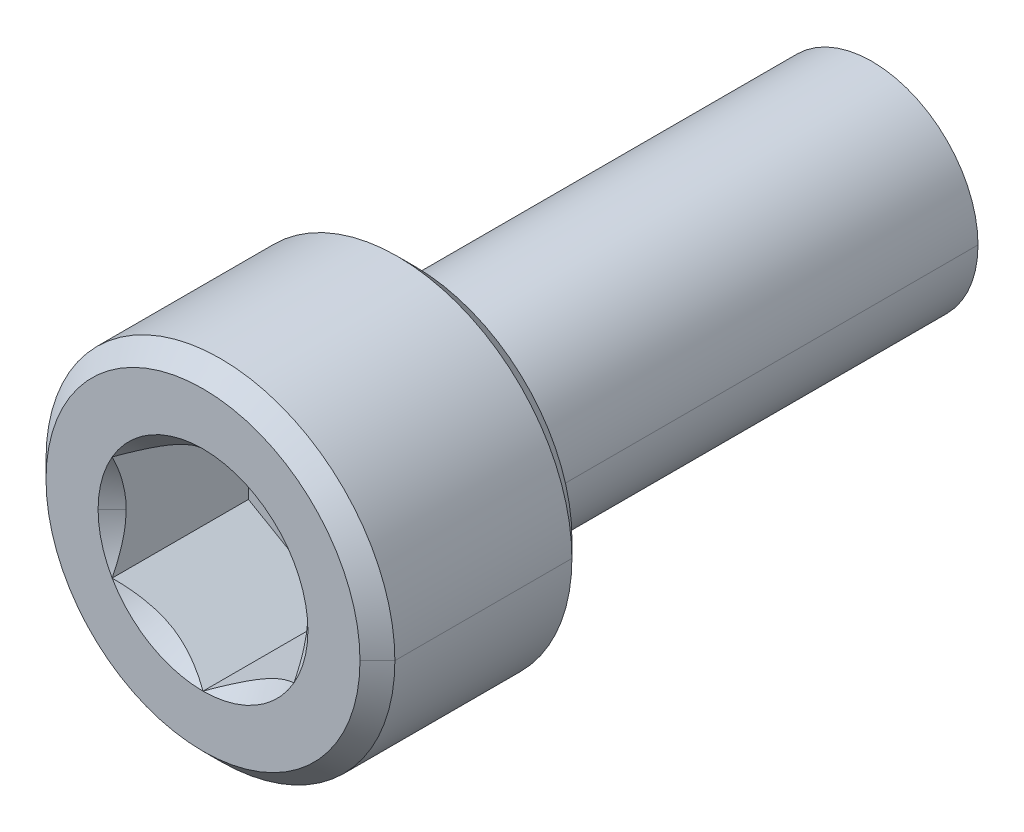
ISO-10303-21;
HEADER;
FILE_DESCRIPTION(('STEP AP214'),'2;1');
FILE_NAME('part.step','',(''),(''),'','','');
FILE_SCHEMA(('AUTOMOTIVE_DESIGN { 1 0 10303 214 1 1 1 1 }'));
ENDSEC;
DATA;
#1=APPLICATION_CONTEXT('core data for automotive mechanical design processes');
#2=APPLICATION_PROTOCOL_DEFINITION('international standard','automotive_design',2000,#1);
#3=PRODUCT_CONTEXT('',#1,'mechanical');
#4=PRODUCT('Part','Part','',(#3));
#5=PRODUCT_RELATED_PRODUCT_CATEGORY('part','',(#4));
#6=PRODUCT_DEFINITION_FORMATION('','',#4);
#7=PRODUCT_DEFINITION_CONTEXT('part definition',#1,'design');
#8=PRODUCT_DEFINITION('design','',#6,#7);
#9=PRODUCT_DEFINITION_SHAPE('','',#8);
#10=(LENGTH_UNIT() NAMED_UNIT(*) SI_UNIT(.MILLI.,.METRE.));
#11=(NAMED_UNIT(*) PLANE_ANGLE_UNIT() SI_UNIT($,.RADIAN.));
#12=(NAMED_UNIT(*) SI_UNIT($,.STERADIAN.) SOLID_ANGLE_UNIT());
#13=UNCERTAINTY_MEASURE_WITH_UNIT(LENGTH_MEASURE(1.E-05),#10,'distance_accuracy_value','');
#14=(GEOMETRIC_REPRESENTATION_CONTEXT(3) GLOBAL_UNCERTAINTY_ASSIGNED_CONTEXT((#13)) GLOBAL_UNIT_ASSIGNED_CONTEXT((#10,
#11,#12)) REPRESENTATION_CONTEXT('',''));
#15=CARTESIAN_POINT('',(0.,0.,0.));
#16=DIRECTION('',(0.,0.,1.));
#17=DIRECTION('',(1.,0.,0.));
#18=AXIS2_PLACEMENT_3D('',#15,#16,#17);
#19=CARTESIAN_POINT('',(10.3682102585368,0.,2.8429));
#20=DIRECTION('',(0.,0.,1.));
#21=DIRECTION('',(-1.,0.,0.));
#22=AXIS2_PLACEMENT_3D('',#19,#20,#21);
#23=CONICAL_SURFACE('',#22,3.429,0.785398163397452);
#24=DIRECTION('',(0.70710678118655,0.,0.707106781186545));
#25=VECTOR('',#24,1.);
#26=CARTESIAN_POINT('',(13.7972102585368,0.,2.8429));
#27=LINE('',#26,#25);
#28=CARTESIAN_POINT('',(13.4543102585468,0.,2.50000000001));
#29=VERTEX_POINT('',#28);
#30=CARTESIAN_POINT('',(13.7972102585468,0.,2.84290000001));
#31=VERTEX_POINT('',#30);
#32=EDGE_CURVE('E492',#29,#31,#27,.T.);
#33=ORIENTED_EDGE('',*,*,#32,.F.);
#34=CARTESIAN_POINT('',(10.3682102585368,0.,2.50000000001));
#35=DIRECTION('',(0.,0.,-1.));
#36=DIRECTION('',(-1.,0.,0.));
#37=AXIS2_PLACEMENT_3D('',#34,#35,#36);
#38=CIRCLE('',#37,3.08610000001);
#39=CARTESIAN_POINT('',(7.2821102585268,0.,2.50000000001));
#40=VERTEX_POINT('',#39);
#41=EDGE_CURVE('E209',#40,#29,#38,.T.);
#42=ORIENTED_EDGE('',*,*,#41,.F.);
#43=DIRECTION('',(-0.70710678118655,0.,0.707106781186545));
#44=VECTOR('',#43,1.);
#45=CARTESIAN_POINT('',(6.9392102585368,0.,2.8429));
#46=LINE('',#45,#44);
#47=CARTESIAN_POINT('',(6.9392102585268,0.,2.84290000001));
#48=VERTEX_POINT('',#47);
#49=EDGE_CURVE('E497',#40,#48,#46,.T.);
#50=ORIENTED_EDGE('',*,*,#49,.T.);
#51=CARTESIAN_POINT('',(10.3682102585368,0.,2.84290000001));
#52=DIRECTION('',(0.,0.,1.));
#53=DIRECTION('',(-1.,0.,0.));
#54=AXIS2_PLACEMENT_3D('',#51,#52,#53);
#55=CIRCLE('',#54,3.42900000001);
#56=EDGE_CURVE('E11',#31,#48,#55,.T.);
#57=ORIENTED_EDGE('',*,*,#56,.F.);
#58=EDGE_LOOP('',(#33,#42,#50,#57));
#59=FACE_BOUND('',#58,.T.);
#60=ADVANCED_FACE('F17',(#59),#23,.T.);
#61=CARTESIAN_POINT('',(10.3682102585368,0.,6.6656));
#62=DIRECTION('',(0.,0.,-1.));
#63=DIRECTION('',(1.,0.,0.));
#64=AXIS2_PLACEMENT_3D('',#61,#62,#63);
#65=CONICAL_SURFACE('',#64,3.0861,0.785398163397446);
#66=DIRECTION('',(-0.707106781186546,0.,-0.707106781186549));
#67=VECTOR('',#66,1.);
#68=CARTESIAN_POINT('',(7.2821102585368,0.,6.6656));
#69=LINE('',#68,#67);
#70=CARTESIAN_POINT('',(7.28211025852679,0.,6.66560000001));
#71=VERTEX_POINT('',#70);
#72=CARTESIAN_POINT('',(6.9392102585268,0.,6.32270000001));
#73=VERTEX_POINT('',#72);
#74=EDGE_CURVE('E304',#71,#73,#69,.T.);
#75=ORIENTED_EDGE('',*,*,#74,.F.);
#76=CARTESIAN_POINT('',(10.3682102585368,0.,6.66560000001));
#77=DIRECTION('',(0.,0.,1.));
#78=DIRECTION('',(-1.,0.,0.));
#79=AXIS2_PLACEMENT_3D('',#76,#77,#78);
#80=CIRCLE('',#79,3.08610000001001);
#81=CARTESIAN_POINT('',(13.4543102585468,0.,6.66560000001));
#82=VERTEX_POINT('',#81);
#83=EDGE_CURVE('E247',#82,#71,#80,.T.);
#84=ORIENTED_EDGE('',*,*,#83,.F.);
#85=DIRECTION('',(0.707106781186546,0.,-0.707106781186549));
#86=VECTOR('',#85,1.);
#87=CARTESIAN_POINT('',(13.4543102585368,0.,6.6656));
#88=LINE('',#87,#86);
#89=CARTESIAN_POINT('',(13.7972102585468,0.,6.32270000001));
#90=VERTEX_POINT('',#89);
#91=EDGE_CURVE('E294',#82,#90,#88,.T.);
#92=ORIENTED_EDGE('',*,*,#91,.T.);
#93=CARTESIAN_POINT('',(10.3682102585368,0.,6.32270000001));
#94=DIRECTION('',(0.,0.,-1.));
#95=DIRECTION('',(-1.,0.,0.));
#96=AXIS2_PLACEMENT_3D('',#93,#94,#95);
#97=CIRCLE('',#96,3.42900000001);
#98=EDGE_CURVE('E29',#73,#90,#97,.T.);
#99=ORIENTED_EDGE('',*,*,#98,.F.);
#100=EDGE_LOOP('',(#75,#84,#92,#99));
#101=FACE_BOUND('',#100,.T.);
#102=ADVANCED_FACE('F295',(#101),#65,.T.);
#103=CARTESIAN_POINT('',(10.3682102585368,0.,6.6656));
#104=DIRECTION('',(0.,0.,1.));
#105=DIRECTION('',(-1.,0.,0.));
#106=AXIS2_PLACEMENT_3D('',#103,#104,#105);
#107=CONICAL_SURFACE('',#106,2.0622229927617,0.78539816339745);
#108=DIRECTION('',(-0.707106781186549,0.,0.707106781186546));
#109=VECTOR('',#108,1.);
#110=CARTESIAN_POINT('',(8.3059872657751,0.,6.6656));
#111=LINE('',#110,#109);
#112=CARTESIAN_POINT('',(8.58227275853682,0.,6.3893145072383));
#113=VERTEX_POINT('',#112);
#114=CARTESIAN_POINT('',(8.3059872657651,0.,6.66560000001));
#115=VERTEX_POINT('',#114);
#116=EDGE_CURVE('E406',#113,#115,#111,.T.);
#117=ORIENTED_EDGE('',*,*,#116,.F.);
#118=CARTESIAN_POINT('',(8.58227275853682,1.03111149638085,6.6656));
#119=CARTESIAN_POINT('',(8.58227275853682,0.478540510842383,6.3893145072383));
#120=CARTESIAN_POINT('',(8.58227275853682,0.,6.3893145072383));
#121=B_SPLINE_CURVE_WITH_KNOTS('',2,(#118,#119,#120),.UNSPECIFIED.,.F.,.F.,(3,3),(0.,1.),.UNSPECIFIED.);
#122=CARTESIAN_POINT('',(8.58227275853682,1.03111149638085,6.6656));
#123=VERTEX_POINT('',#122);
#124=EDGE_CURVE('E341',#123,#113,#121,.T.);
#125=ORIENTED_EDGE('',*,*,#124,.F.);
#126=CARTESIAN_POINT('',(10.3682102585368,0.,6.66560000001));
#127=DIRECTION('',(0.,0.,1.));
#128=DIRECTION('',(-1.,0.,0.));
#129=AXIS2_PLACEMENT_3D('',#126,#127,#128);
#130=CIRCLE('',#129,2.0622229927717);
#131=EDGE_CURVE('E251',#123,#115,#130,.T.);
#132=ORIENTED_EDGE('',*,*,#131,.T.);
#133=EDGE_LOOP('',(#117,#125,#132));
#134=FACE_BOUND('',#133,.T.);
#135=ADVANCED_FACE('F888',(#134),#107,.F.);
#136=CARTESIAN_POINT('',(10.3682102585368,0.,6.6656));
#137=DIRECTION('',(0.,0.,-1.));
#138=DIRECTION('',(1.,0.,0.));
#139=AXIS2_PLACEMENT_3D('',#136,#137,#138);
#140=CYLINDRICAL_SURFACE('',#139,3.429);
#141=DIRECTION('',(0.,0.,-1.));
#142=VECTOR('',#141,1.);
#143=CARTESIAN_POINT('',(6.9392102585368,0.,6.6656));
#144=LINE('',#143,#142);
#145=EDGE_CURVE('E273',#73,#48,#144,.T.);
#146=ORIENTED_EDGE('',*,*,#145,.F.);
#147=ORIENTED_EDGE('',*,*,#98,.T.);
#148=DIRECTION('',(0.,0.,-1.));
#149=VECTOR('',#148,1.);
#150=CARTESIAN_POINT('',(13.7972102585368,0.,6.6656));
#151=LINE('',#150,#149);
#152=EDGE_CURVE('E269',#90,#31,#151,.T.);
#153=ORIENTED_EDGE('',*,*,#152,.T.);
#154=ORIENTED_EDGE('',*,*,#56,.T.);
#155=EDGE_LOOP('',(#146,#147,#153,#154));
#156=FACE_BOUND('',#155,.T.);
#157=ADVANCED_FACE('F267',(#156),#140,.T.);
#158=CARTESIAN_POINT('',(10.3682102585368,0.,-7.025));
#159=DIRECTION('',(0.,0.,1.));
#160=DIRECTION('',(-1.,0.,0.));
#161=AXIS2_PLACEMENT_3D('',#158,#159,#160);
#162=CONICAL_SURFACE('',#161,1.31324425180957,0.959931088596884);
#163=DIRECTION('',(0.819152044288993,0.,0.573576436351044));
#164=VECTOR('',#163,1.);
#165=CARTESIAN_POINT('',(11.6814545103464,0.,-7.025));
#166=LINE('',#165,#164);
#167=CARTESIAN_POINT('',(11.6814545103564,0.,-7.025));
#168=VERTEX_POINT('',#167);
#169=CARTESIAN_POINT('',(12.4510102585468,0.,-6.48615126403445));
#170=VERTEX_POINT('',#169);
#171=EDGE_CURVE('E506',#168,#170,#166,.T.);
#172=ORIENTED_EDGE('',*,*,#171,.F.);
#173=CARTESIAN_POINT('',(10.3682102585368,0.,-7.025));
#174=DIRECTION('',(0.,0.,-1.));
#175=DIRECTION('',(1.,0.,0.));
#176=AXIS2_PLACEMENT_3D('',#173,#174,#175);
#177=CIRCLE('',#176,1.31324425181957);
#178=CARTESIAN_POINT('',(9.05496600671723,0.,-7.025));
#179=VERTEX_POINT('',#178);
#180=EDGE_CURVE('E256',#179,#168,#177,.T.);
#181=ORIENTED_EDGE('',*,*,#180,.F.);
#182=DIRECTION('',(-0.819152044288993,0.,0.573576436351044));
#183=VECTOR('',#182,1.);
#184=CARTESIAN_POINT('',(9.05496600672723,0.,-7.025));
#185=LINE('',#184,#183);
#186=CARTESIAN_POINT('',(8.2854102585268,0.,-6.48615126403445));
#187=VERTEX_POINT('',#186);
#188=EDGE_CURVE('E319',#179,#187,#185,.T.);
#189=ORIENTED_EDGE('',*,*,#188,.T.);
#190=CARTESIAN_POINT('',(10.3682102585368,0.,-6.48615126403445));
#191=DIRECTION('',(0.,0.,-1.));
#192=DIRECTION('',(1.,0.,0.));
#193=AXIS2_PLACEMENT_3D('',#190,#191,#192);
#194=CIRCLE('',#193,2.08280000001);
#195=EDGE_CURVE('E252',#187,#170,#194,.T.);
#196=ORIENTED_EDGE('',*,*,#195,.T.);
#197=EDGE_LOOP('',(#172,#181,#189,#196));
#198=FACE_BOUND('',#197,.T.);
#199=ADVANCED_FACE('F827',(#198),#162,.T.);
#200=CARTESIAN_POINT('',(10.3682102585368,0.,2.5));
#201=DIRECTION('',(0.,0.,-1.));
#202=DIRECTION('',(1.,0.,0.));
#203=AXIS2_PLACEMENT_3D('',#200,#201,#202);
#204=CYLINDRICAL_SURFACE('',#203,2.0828);
#205=DIRECTION('',(0.,0.,-1.));
#206=VECTOR('',#205,1.);
#207=CARTESIAN_POINT('',(8.2854102585368,0.,2.5));
#208=LINE('',#207,#206);
#209=CARTESIAN_POINT('',(8.2854102585268,0.,2.50000000001));
#210=VERTEX_POINT('',#209);
#211=EDGE_CURVE('E324',#210,#187,#208,.T.);
#212=ORIENTED_EDGE('',*,*,#211,.F.);
#213=CARTESIAN_POINT('',(10.3682102585368,0.,2.50000000001));
#214=DIRECTION('',(0.,0.,-1.));
#215=DIRECTION('',(-1.,0.,0.));
#216=AXIS2_PLACEMENT_3D('',#213,#214,#215);
#217=CIRCLE('',#216,2.08280000001);
#218=CARTESIAN_POINT('',(12.4510102585468,0.,2.50000000001));
#219=VERTEX_POINT('',#218);
#220=EDGE_CURVE('E243',#210,#219,#217,.T.);
#221=ORIENTED_EDGE('',*,*,#220,.T.);
#222=DIRECTION('',(0.,0.,-1.));
#223=VECTOR('',#222,1.);
#224=CARTESIAN_POINT('',(12.4510102585368,0.,2.5));
#225=LINE('',#224,#223);
#226=EDGE_CURVE('E328',#219,#170,#225,.T.);
#227=ORIENTED_EDGE('',*,*,#226,.T.);
#228=ORIENTED_EDGE('',*,*,#195,.F.);
#229=EDGE_LOOP('',(#212,#221,#227,#228));
#230=FACE_BOUND('',#229,.T.);
#231=ADVANCED_FACE('F148',(#230),#204,.T.);
#232=CARTESIAN_POINT('',(10.3682102585368,0.,-7.025));
#233=DIRECTION('',(0.,0.,-1.));
#234=DIRECTION('',(0.,-1.,0.));
#235=AXIS2_PLACEMENT_3D('',#232,#233,#234);
#236=PLANE('',#235);
#237=ORIENTED_EDGE('',*,*,#180,.T.);
#238=CARTESIAN_POINT('',(10.3682102585368,0.,-7.025));
#239=DIRECTION('',(0.,0.,-1.));
#240=DIRECTION('',(1.,0.,0.));
#241=AXIS2_PLACEMENT_3D('',#238,#239,#240);
#242=CIRCLE('',#241,1.31324425181957);
#243=EDGE_CURVE('E290',#168,#179,#242,.T.);
#244=ORIENTED_EDGE('',*,*,#243,.T.);
#245=EDGE_LOOP('',(#237,#244));
#246=FACE_BOUND('',#245,.T.);
#247=ADVANCED_FACE('F802',(#246),#236,.T.);
#248=CARTESIAN_POINT('',(10.3682102585368,0.,6.6656));
#249=DIRECTION('',(0.,0.,1.));
#250=DIRECTION('',(1.,0.,0.));
#251=AXIS2_PLACEMENT_3D('',#248,#249,#250);
#252=PLANE('',#251);
#253=CARTESIAN_POINT('',(10.3682102585368,0.,6.66560000001));
#254=DIRECTION('',(0.,0.,1.));
#255=DIRECTION('',(-1.,0.,0.));
#256=AXIS2_PLACEMENT_3D('',#253,#254,#255);
#257=CIRCLE('',#256,2.0622229927717);
#258=CARTESIAN_POINT('',(8.58227275853682,-1.03111149638085,6.6656));
#259=VERTEX_POINT('',#258);
#260=CARTESIAN_POINT('',(10.3682102585368,-2.0622229927617,6.6656));
#261=VERTEX_POINT('',#260);
#262=EDGE_CURVE('E212',#259,#261,#257,.T.);
#263=ORIENTED_EDGE('',*,*,#262,.F.);
#264=CARTESIAN_POINT('',(10.3682102585368,0.,6.66560000001));
#265=DIRECTION('',(0.,0.,1.));
#266=DIRECTION('',(-1.,0.,0.));
#267=AXIS2_PLACEMENT_3D('',#264,#265,#266);
#268=CIRCLE('',#267,2.0622229927717);
#269=EDGE_CURVE('E318',#115,#259,#268,.T.);
#270=ORIENTED_EDGE('',*,*,#269,.F.);
#271=ORIENTED_EDGE('',*,*,#131,.F.);
#272=CARTESIAN_POINT('',(10.3682102585368,0.,6.66560000001));
#273=DIRECTION('',(0.,0.,1.));
#274=DIRECTION('',(-1.,0.,0.));
#275=AXIS2_PLACEMENT_3D('',#272,#273,#274);
#276=CIRCLE('',#275,2.0622229927717);
#277=CARTESIAN_POINT('',(10.3682102585368,2.0622229927617,6.6656));
#278=VERTEX_POINT('',#277);
#279=EDGE_CURVE('E89',#278,#123,#276,.T.);
#280=ORIENTED_EDGE('',*,*,#279,.F.);
#281=CARTESIAN_POINT('',(10.3682102585368,0.,6.66560000001));
#282=DIRECTION('',(0.,0.,1.));
#283=DIRECTION('',(-1.,0.,0.));
#284=AXIS2_PLACEMENT_3D('',#281,#282,#283);
#285=CIRCLE('',#284,2.0622229927717);
#286=CARTESIAN_POINT('',(12.1541477585368,1.03111149638085,6.6656));
#287=VERTEX_POINT('',#286);
#288=EDGE_CURVE('E82',#287,#278,#285,.T.);
#289=ORIENTED_EDGE('',*,*,#288,.F.);
#290=CARTESIAN_POINT('',(10.3682102585368,0.,6.66560000001));
#291=DIRECTION('',(0.,0.,1.));
#292=DIRECTION('',(-1.,0.,0.));
#293=AXIS2_PLACEMENT_3D('',#290,#291,#292);
#294=CIRCLE('',#293,2.0622229927717);
#295=CARTESIAN_POINT('',(12.1541477585368,-1.03111149638085,6.6656));
#296=VERTEX_POINT('',#295);
#297=EDGE_CURVE('E72',#296,#287,#294,.T.);
#298=ORIENTED_EDGE('',*,*,#297,.F.);
#299=CARTESIAN_POINT('',(10.3682102585368,0.,6.66560000001));
#300=DIRECTION('',(0.,0.,1.));
#301=DIRECTION('',(-1.,0.,0.));
#302=AXIS2_PLACEMENT_3D('',#299,#300,#301);
#303=CIRCLE('',#302,2.0622229927717);
#304=EDGE_CURVE('E42',#261,#296,#303,.T.);
#305=ORIENTED_EDGE('',*,*,#304,.F.);
#306=EDGE_LOOP('',(#263,#270,#271,#280,#289,#298,#305));
#307=FACE_BOUND('',#306,.T.);
#308=ORIENTED_EDGE('',*,*,#83,.T.);
#309=CARTESIAN_POINT('',(10.3682102585368,0.,6.66560000001));
#310=DIRECTION('',(0.,0.,1.));
#311=DIRECTION('',(-1.,0.,0.));
#312=AXIS2_PLACEMENT_3D('',#309,#310,#311);
#313=CIRCLE('',#312,3.08610000001001);
#314=EDGE_CURVE('E310',#71,#82,#313,.T.);
#315=ORIENTED_EDGE('',*,*,#314,.T.);
#316=EDGE_LOOP('',(#308,#315));
#317=FACE_BOUND('',#316,.T.);
#318=ADVANCED_FACE('F86',(#307,#317),#252,.T.);
#319=CARTESIAN_POINT('',(10.3682102585368,0.,2.5));
#320=DIRECTION('',(0.,0.,1.));
#321=DIRECTION('',(1.,0.,0.));
#322=AXIS2_PLACEMENT_3D('',#319,#320,#321);
#323=PLANE('',#322);
#324=CARTESIAN_POINT('',(10.3682102585368,0.,2.50000000001));
#325=DIRECTION('',(0.,0.,-1.));
#326=DIRECTION('',(-1.,0.,0.));
#327=AXIS2_PLACEMENT_3D('',#324,#325,#326);
#328=CIRCLE('',#327,2.08280000001);
#329=EDGE_CURVE('E323',#219,#210,#328,.T.);
#330=ORIENTED_EDGE('',*,*,#329,.F.);
#331=ORIENTED_EDGE('',*,*,#220,.F.);
#332=EDGE_LOOP('',(#330,#331));
#333=FACE_BOUND('',#332,.T.);
#334=ORIENTED_EDGE('',*,*,#41,.T.);
#335=CARTESIAN_POINT('',(10.3682102585368,0.,2.50000000001));
#336=DIRECTION('',(0.,0.,-1.));
#337=DIRECTION('',(-1.,0.,0.));
#338=AXIS2_PLACEMENT_3D('',#335,#336,#337);
#339=CIRCLE('',#338,3.08610000001);
#340=EDGE_CURVE('E490',#29,#40,#339,.T.);
#341=ORIENTED_EDGE('',*,*,#340,.T.);
#342=EDGE_LOOP('',(#334,#341));
#343=FACE_BOUND('',#342,.T.);
#344=ADVANCED_FACE('F801',(#333,#343),#323,.F.);
#345=CARTESIAN_POINT('',(10.3682102585368,0.,6.6656));
#346=DIRECTION('',(0.,0.,1.));
#347=DIRECTION('',(-1.,0.,0.));
#348=AXIS2_PLACEMENT_3D('',#345,#346,#347);
#349=CONICAL_SURFACE('',#348,2.0622229927617,0.78539816339745);
#350=ORIENTED_EDGE('',*,*,#304,.T.);
#351=CARTESIAN_POINT('',(10.3682102585368,-2.0622229927617,6.6656));
#352=CARTESIAN_POINT('',(10.8441239207496,-1.78745411177214,6.39083111904718));
#353=CARTESIAN_POINT('',(11.2578899302854,-1.5485661947851,6.38931854547226));
#354=CARTESIAN_POINT('',(11.6729859664147,-1.30891038658632,6.3878011098182));
#355=CARTESIAN_POINT('',(12.1541477585368,-1.03111149638085,6.6656));
#356=B_SPLINE_CURVE_WITH_KNOTS('',2,(#351,#352,#353,#354,#355),.UNSPECIFIED.,.F.,.F.,(3,2,3),
(0.,0.5,1.),.UNSPECIFIED.);
#357=EDGE_CURVE('E197',#261,#296,#356,.T.);
#358=ORIENTED_EDGE('',*,*,#357,.F.);
#359=EDGE_LOOP('',(#350,#358));
#360=FACE_BOUND('',#359,.T.);
#361=ADVANCED_FACE('F159',(#360),#349,.F.);
#362=CARTESIAN_POINT('',(10.3682102585368,0.,6.6656));
#363=DIRECTION('',(0.,0.,1.));
#364=DIRECTION('',(-1.,0.,0.));
#365=AXIS2_PLACEMENT_3D('',#362,#363,#364);
#366=CONICAL_SURFACE('',#365,2.0622229927617,0.78539816339745);
#367=ORIENTED_EDGE('',*,*,#297,.T.);
#368=CARTESIAN_POINT('',(12.1541477585368,-1.03111149638085,6.6656));
#369=CARTESIAN_POINT('',(12.1541477585368,-0.479143676751824,6.38961609020099));
#370=CARTESIAN_POINT('',(12.1541477585368,-0.000112420350078125,6.3893145107866));
#371=CARTESIAN_POINT('',(12.1541477585368,0.47793859333943,6.38901354849482));
#372=CARTESIAN_POINT('',(12.1541477585368,1.03111149638085,6.6656));
#373=B_SPLINE_CURVE_WITH_KNOTS('',2,(#368,#369,#370,#371,#372),.UNSPECIFIED.,.F.,.F.,(3,2,3),
(0.,0.5,1.),.UNSPECIFIED.);
#374=EDGE_CURVE('E76',#296,#287,#373,.T.);
#375=ORIENTED_EDGE('',*,*,#374,.F.);
#376=EDGE_LOOP('',(#367,#375));
#377=FACE_BOUND('',#376,.T.);
#378=ADVANCED_FACE('F74',(#377),#366,.F.);
#379=CARTESIAN_POINT('',(10.3682102585368,0.,6.6656));
#380=DIRECTION('',(0.,0.,1.));
#381=DIRECTION('',(-1.,0.,0.));
#382=AXIS2_PLACEMENT_3D('',#379,#380,#381);
#383=CONICAL_SURFACE('',#382,2.0622229927617,0.78539816339745);
#384=ORIENTED_EDGE('',*,*,#288,.T.);
#385=CARTESIAN_POINT('',(12.1541477585368,1.03111149638085,6.6656));
#386=CARTESIAN_POINT('',(11.6782340963436,1.30588037735913,6.39083111904708));
#387=CARTESIAN_POINT('',(11.2644680867946,1.54476829435377,6.38931854547226));
#388=CARTESIAN_POINT('',(10.8493720506808,1.78442410254362,6.38780110981842));
#389=CARTESIAN_POINT('',(10.3682102585368,2.0622229927617,6.6656));
#390=B_SPLINE_CURVE_WITH_KNOTS('',2,(#385,#386,#387,#388,#389),.UNSPECIFIED.,.F.,.F.,(3,2,3),
(0.,0.5,1.),.UNSPECIFIED.);
#391=EDGE_CURVE('E108',#287,#278,#390,.T.);
#392=ORIENTED_EDGE('',*,*,#391,.F.);
#393=EDGE_LOOP('',(#384,#392));
#394=FACE_BOUND('',#393,.T.);
#395=ADVANCED_FACE('F110',(#394),#383,.F.);
#396=CARTESIAN_POINT('',(10.3682102585368,0.,6.6656));
#397=DIRECTION('',(0.,0.,1.));
#398=DIRECTION('',(-1.,0.,0.));
#399=AXIS2_PLACEMENT_3D('',#396,#397,#398);
#400=CONICAL_SURFACE('',#399,2.0622229927617,0.78539816339745);
#401=ORIENTED_EDGE('',*,*,#279,.T.);
#402=CARTESIAN_POINT('',(10.3682102585368,2.0622229927617,6.6656));
#403=CARTESIAN_POINT('',(9.89229659632461,1.78745411177247,6.39083111904882));
#404=CARTESIAN_POINT('',(9.47853058678823,1.54856619478512,6.38931854547226));
#405=CARTESIAN_POINT('',(9.06343455066165,1.3089103865879,6.3878011098166));
#406=CARTESIAN_POINT('',(8.58227275853681,1.03111149638086,6.6656));
#407=B_SPLINE_CURVE_WITH_KNOTS('',2,(#402,#403,#404,#405,#406),.UNSPECIFIED.,.F.,.F.,(3,2,3),
(0.,0.5,1.),.UNSPECIFIED.);
#408=EDGE_CURVE('E129',#278,#123,#407,.T.);
#409=ORIENTED_EDGE('',*,*,#408,.F.);
#410=EDGE_LOOP('',(#401,#409));
#411=FACE_BOUND('',#410,.T.);
#412=ADVANCED_FACE('F457',(#411),#400,.F.);
#413=CARTESIAN_POINT('',(10.3682102585368,0.,6.6656));
#414=DIRECTION('',(0.,0.,1.));
#415=DIRECTION('',(-1.,0.,0.));
#416=AXIS2_PLACEMENT_3D('',#413,#414,#415);
#417=CONICAL_SURFACE('',#416,2.0622229927617,0.78539816339745);
#418=ORIENTED_EDGE('',*,*,#262,.T.);
#419=CARTESIAN_POINT('',(8.58227275853682,-1.03111149638085,6.6656));
#420=CARTESIAN_POINT('',(9.05818642072837,-1.30588037735816,6.39083111904806));
#421=CARTESIAN_POINT('',(9.47195243027909,-1.54476829435379,6.38931854547227));
#422=CARTESIAN_POINT('',(9.88704846638885,-1.78442410254131,6.38780110981747));
#423=CARTESIAN_POINT('',(10.3682102585368,-2.06222299276169,6.6656));
#424=B_SPLINE_CURVE_WITH_KNOTS('',2,(#419,#420,#421,#422,#423),.UNSPECIFIED.,.F.,.F.,(3,2,3),
(0.,0.5,1.),.UNSPECIFIED.);
#425=EDGE_CURVE('E223',#259,#261,#424,.T.);
#426=ORIENTED_EDGE('',*,*,#425,.F.);
#427=EDGE_LOOP('',(#418,#426));
#428=FACE_BOUND('',#427,.T.);
#429=ADVANCED_FACE('F154',(#428),#417,.F.);
#430=CARTESIAN_POINT('',(12.1541477585368,-3.09333448914254,3.98669375));
#431=DIRECTION('',(0.,0.,1.));
#432=DIRECTION('',(1.,0.,0.));
#433=AXIS2_PLACEMENT_3D('',#430,#431,#432);
#434=PLANE('',#433);
#435=DIRECTION('',(0.866025403784438,-0.5,0.));
#436=VECTOR('',#435,1.);
#437=CARTESIAN_POINT('',(8.58227275852682,-1.03111149639085,3.98669375001));
#438=LINE('',#437,#436);
#439=CARTESIAN_POINT('',(8.58227275853682,-1.03111149638085,3.98669375));
#440=VERTEX_POINT('',#439);
#441=CARTESIAN_POINT('',(10.3682102585368,-2.0622229927617,3.98669375));
#442=VERTEX_POINT('',#441);
#443=EDGE_CURVE('E222',#440,#442,#438,.T.);
#444=ORIENTED_EDGE('',*,*,#443,.T.);
#445=DIRECTION('',(0.866025403784438,0.5,0.));
#446=VECTOR('',#445,1.);
#447=CARTESIAN_POINT('',(10.3682102585368,-2.0622229927717,3.98669375001));
#448=LINE('',#447,#446);
#449=CARTESIAN_POINT('',(12.1541477585368,-1.03111149638085,3.98669375));
#450=VERTEX_POINT('',#449);
#451=EDGE_CURVE('E216',#442,#450,#448,.T.);
#452=ORIENTED_EDGE('',*,*,#451,.T.);
#453=DIRECTION('',(0.,1.,0.));
#454=VECTOR('',#453,1.);
#455=CARTESIAN_POINT('',(12.1541477585468,-1.03111149639085,3.98669375001));
#456=LINE('',#455,#454);
#457=CARTESIAN_POINT('',(12.1541477585368,1.03111149638085,3.98669375));
#458=VERTEX_POINT('',#457);
#459=EDGE_CURVE('E105',#450,#458,#456,.T.);
#460=ORIENTED_EDGE('',*,*,#459,.T.);
#461=DIRECTION('',(-0.866025403784438,0.5,0.));
#462=VECTOR('',#461,1.);
#463=CARTESIAN_POINT('',(12.1541477585468,1.03111149639085,3.98669375001));
#464=LINE('',#463,#462);
#465=CARTESIAN_POINT('',(10.3682102585368,2.0622229927617,3.98669375));
#466=VERTEX_POINT('',#465);
#467=EDGE_CURVE('E116',#458,#466,#464,.T.);
#468=ORIENTED_EDGE('',*,*,#467,.T.);
#469=DIRECTION('',(-0.866025403784438,-0.5,0.));
#470=VECTOR('',#469,1.);
#471=CARTESIAN_POINT('',(10.3682102585368,2.0622229927717,3.98669375001));
#472=LINE('',#471,#470);
#473=CARTESIAN_POINT('',(8.58227275853682,1.03111149638085,3.98669375));
#474=VERTEX_POINT('',#473);
#475=EDGE_CURVE('E123',#466,#474,#472,.T.);
#476=ORIENTED_EDGE('',*,*,#475,.T.);
#477=DIRECTION('',(0.,-1.,0.));
#478=VECTOR('',#477,1.);
#479=CARTESIAN_POINT('',(8.58227275852682,1.03111149639085,3.98669375001));
#480=LINE('',#479,#478);
#481=EDGE_CURVE('E337',#474,#440,#480,.T.);
#482=ORIENTED_EDGE('',*,*,#481,.T.);
#483=EDGE_LOOP('',(#444,#452,#460,#468,#476,#482));
#484=FACE_BOUND('',#483,.T.);
#485=ADVANCED_FACE('F150',(#484),#434,.T.);
#486=CARTESIAN_POINT('',(10.3682102585368,-2.0622229927617,3.98669375));
#487=DIRECTION('',(0.5,-0.866025403784439,0.));
#488=DIRECTION('',(0.,0.,-1.));
#489=AXIS2_PLACEMENT_3D('',#486,#487,#488);
#490=PLANE('',#489);
#491=DIRECTION('',(0.,0.,1.));
#492=VECTOR('',#491,1.);
#493=CARTESIAN_POINT('',(10.3682102585368,-2.0622229927717,3.98669375001));
#494=LINE('',#493,#492);
#495=EDGE_CURVE('E219',#442,#261,#494,.T.);
#496=ORIENTED_EDGE('',*,*,#495,.T.);
#497=ORIENTED_EDGE('',*,*,#357,.T.);
#498=DIRECTION('',(0.,0.,1.));
#499=VECTOR('',#498,1.);
#500=CARTESIAN_POINT('',(12.1541477585468,-1.03111149639085,3.98669375001));
#501=LINE('',#500,#499);
#502=EDGE_CURVE('E103',#450,#296,#501,.T.);
#503=ORIENTED_EDGE('',*,*,#502,.F.);
#504=ORIENTED_EDGE('',*,*,#451,.F.);
#505=EDGE_LOOP('',(#496,#497,#503,#504));
#506=FACE_BOUND('',#505,.T.);
#507=ADVANCED_FACE('F153',(#506),#490,.F.);
#508=CARTESIAN_POINT('',(12.1541477585368,-1.03111149638085,3.98669375));
#509=DIRECTION('',(1.,0.,0.));
#510=DIRECTION('',(0.,1.,0.));
#511=AXIS2_PLACEMENT_3D('',#508,#509,#510);
#512=PLANE('',#511);
#513=ORIENTED_EDGE('',*,*,#502,.T.);
#514=ORIENTED_EDGE('',*,*,#374,.T.);
#515=DIRECTION('',(0.,0.,1.));
#516=VECTOR('',#515,1.);
#517=CARTESIAN_POINT('',(12.1541477585468,1.03111149639085,3.98669375001));
#518=LINE('',#517,#516);
#519=EDGE_CURVE('E101',#458,#287,#518,.T.);
#520=ORIENTED_EDGE('',*,*,#519,.F.);
#521=ORIENTED_EDGE('',*,*,#459,.F.);
#522=EDGE_LOOP('',(#513,#514,#520,#521));
#523=FACE_BOUND('',#522,.T.);
#524=ADVANCED_FACE('F98',(#523),#512,.F.);
#525=CARTESIAN_POINT('',(12.1541477585368,1.03111149638085,3.98669375));
#526=DIRECTION('',(0.5,0.866025403784439,0.));
#527=DIRECTION('',(0.,0.,-1.));
#528=AXIS2_PLACEMENT_3D('',#525,#526,#527);
#529=PLANE('',#528);
#530=ORIENTED_EDGE('',*,*,#519,.T.);
#531=ORIENTED_EDGE('',*,*,#391,.T.);
#532=DIRECTION('',(0.,0.,1.));
#533=VECTOR('',#532,1.);
#534=CARTESIAN_POINT('',(10.3682102585368,2.0622229927717,3.98669375001));
#535=LINE('',#534,#533);
#536=EDGE_CURVE('E340',#466,#278,#535,.T.);
#537=ORIENTED_EDGE('',*,*,#536,.F.);
#538=ORIENTED_EDGE('',*,*,#467,.F.);
#539=EDGE_LOOP('',(#530,#531,#537,#538));
#540=FACE_BOUND('',#539,.T.);
#541=ADVANCED_FACE('F120',(#540),#529,.F.);
#542=CARTESIAN_POINT('',(10.3682102585368,2.0622229927617,3.98669375));
#543=DIRECTION('',(-0.5,0.866025403784439,0.));
#544=DIRECTION('',(0.,0.,1.));
#545=AXIS2_PLACEMENT_3D('',#542,#543,#544);
#546=PLANE('',#545);
#547=ORIENTED_EDGE('',*,*,#536,.T.);
#548=ORIENTED_EDGE('',*,*,#408,.T.);
#549=DIRECTION('',(0.,0.,1.));
#550=VECTOR('',#549,1.);
#551=CARTESIAN_POINT('',(8.58227275852682,1.03111149639085,3.98669375001));
#552=LINE('',#551,#550);
#553=EDGE_CURVE('E336',#474,#123,#552,.T.);
#554=ORIENTED_EDGE('',*,*,#553,.F.);
#555=ORIENTED_EDGE('',*,*,#475,.F.);
#556=EDGE_LOOP('',(#547,#548,#554,#555));
#557=FACE_BOUND('',#556,.T.);
#558=ADVANCED_FACE('F147',(#557),#546,.F.);
#559=CARTESIAN_POINT('',(8.58227275853682,1.03111149638085,3.98669375));
#560=DIRECTION('',(-1.,0.,0.));
#561=DIRECTION('',(0.,1.,0.));
#562=AXIS2_PLACEMENT_3D('',#559,#560,#561);
#563=PLANE('',#562);
#564=ORIENTED_EDGE('',*,*,#553,.T.);
#565=ORIENTED_EDGE('',*,*,#124,.T.);
#566=CARTESIAN_POINT('',(8.58227275853682,0.,6.3893145072383));
#567=CARTESIAN_POINT('',(8.58227275853682,-0.478540510842435,6.3893145072383));
#568=CARTESIAN_POINT('',(8.58227275853682,-1.03111149638085,6.6656));
#569=B_SPLINE_CURVE_WITH_KNOTS('',2,(#566,#567,#568),.UNSPECIFIED.,.F.,.F.,(3,3),(0.,1.),.UNSPECIFIED.);
#570=EDGE_CURVE('E301',#113,#259,#569,.T.);
#571=ORIENTED_EDGE('',*,*,#570,.T.);
#572=DIRECTION('',(0.,0.,1.));
#573=VECTOR('',#572,1.);
#574=CARTESIAN_POINT('',(8.58227275852682,-1.03111149639085,3.98669375001));
#575=LINE('',#574,#573);
#576=EDGE_CURVE('E332',#440,#259,#575,.T.);
#577=ORIENTED_EDGE('',*,*,#576,.F.);
#578=ORIENTED_EDGE('',*,*,#481,.F.);
#579=EDGE_LOOP('',(#564,#565,#571,#577,#578));
#580=FACE_BOUND('',#579,.T.);
#581=ADVANCED_FACE('F376',(#580),#563,.F.);
#582=CARTESIAN_POINT('',(8.58227275853682,-1.03111149638085,3.98669375));
#583=DIRECTION('',(-0.5,-0.866025403784439,0.));
#584=DIRECTION('',(-0.866025403784439,0.5,0.));
#585=AXIS2_PLACEMENT_3D('',#582,#583,#584);
#586=PLANE('',#585);
#587=ORIENTED_EDGE('',*,*,#576,.T.);
#588=ORIENTED_EDGE('',*,*,#425,.T.);
#589=ORIENTED_EDGE('',*,*,#495,.F.);
#590=ORIENTED_EDGE('',*,*,#443,.F.);
#591=EDGE_LOOP('',(#587,#588,#589,#590));
#592=FACE_BOUND('',#591,.T.);
#593=ADVANCED_FACE('F385',(#592),#586,.F.);
#594=CARTESIAN_POINT('',(10.3682102585368,0.,2.5));
#595=DIRECTION('',(0.,0.,-1.));
#596=DIRECTION('',(1.,0.,0.));
#597=AXIS2_PLACEMENT_3D('',#594,#595,#596);
#598=CYLINDRICAL_SURFACE('',#597,2.0828);
#599=ORIENTED_EDGE('',*,*,#329,.T.);
#600=ORIENTED_EDGE('',*,*,#211,.T.);
#601=CARTESIAN_POINT('',(10.3682102585368,0.,-6.48615126403445));
#602=DIRECTION('',(0.,0.,-1.));
#603=DIRECTION('',(1.,0.,0.));
#604=AXIS2_PLACEMENT_3D('',#601,#602,#603);
#605=CIRCLE('',#604,2.08280000001);
#606=EDGE_CURVE('E313',#170,#187,#605,.T.);
#607=ORIENTED_EDGE('',*,*,#606,.F.);
#608=ORIENTED_EDGE('',*,*,#226,.F.);
#609=EDGE_LOOP('',(#599,#600,#607,#608));
#610=FACE_BOUND('',#609,.T.);
#611=ADVANCED_FACE('F445',(#610),#598,.T.);
#612=CARTESIAN_POINT('',(10.3682102585368,0.,-7.025));
#613=DIRECTION('',(0.,0.,1.));
#614=DIRECTION('',(-1.,0.,0.));
#615=AXIS2_PLACEMENT_3D('',#612,#613,#614);
#616=CONICAL_SURFACE('',#615,1.31324425180957,0.959931088596884);
#617=ORIENTED_EDGE('',*,*,#243,.F.);
#618=ORIENTED_EDGE('',*,*,#171,.T.);
#619=ORIENTED_EDGE('',*,*,#606,.T.);
#620=ORIENTED_EDGE('',*,*,#188,.F.);
#621=EDGE_LOOP('',(#617,#618,#619,#620));
#622=FACE_BOUND('',#621,.T.);
#623=ADVANCED_FACE('F446',(#622),#616,.T.);
#624=CARTESIAN_POINT('',(10.3682102585368,0.,6.6656));
#625=DIRECTION('',(0.,0.,-1.));
#626=DIRECTION('',(1.,0.,0.));
#627=AXIS2_PLACEMENT_3D('',#624,#625,#626);
#628=CYLINDRICAL_SURFACE('',#627,3.429);
#629=CARTESIAN_POINT('',(10.3682102585368,0.,6.32270000001));
#630=DIRECTION('',(0.,0.,-1.));
#631=DIRECTION('',(-1.,0.,0.));
#632=AXIS2_PLACEMENT_3D('',#629,#630,#631);
#633=CIRCLE('',#632,3.42900000001);
#634=EDGE_CURVE('E284',#90,#73,#633,.T.);
#635=ORIENTED_EDGE('',*,*,#634,.T.);
#636=ORIENTED_EDGE('',*,*,#145,.T.);
#637=CARTESIAN_POINT('',(10.3682102585368,0.,2.84290000001));
#638=DIRECTION('',(0.,0.,1.));
#639=DIRECTION('',(-1.,0.,0.));
#640=AXIS2_PLACEMENT_3D('',#637,#638,#639);
#641=CIRCLE('',#640,3.42900000001);
#642=EDGE_CURVE('E287',#48,#31,#641,.T.);
#643=ORIENTED_EDGE('',*,*,#642,.T.);
#644=ORIENTED_EDGE('',*,*,#152,.F.);
#645=EDGE_LOOP('',(#635,#636,#643,#644));
#646=FACE_BOUND('',#645,.T.);
#647=ADVANCED_FACE('F282',(#646),#628,.T.);
#648=CARTESIAN_POINT('',(10.3682102585368,0.,6.6656));
#649=DIRECTION('',(0.,0.,1.));
#650=DIRECTION('',(-1.,0.,0.));
#651=AXIS2_PLACEMENT_3D('',#648,#649,#650);
#652=CONICAL_SURFACE('',#651,2.0622229927617,0.78539816339745);
#653=ORIENTED_EDGE('',*,*,#570,.F.);
#654=ORIENTED_EDGE('',*,*,#116,.T.);
#655=ORIENTED_EDGE('',*,*,#269,.T.);
#656=EDGE_LOOP('',(#653,#654,#655));
#657=FACE_BOUND('',#656,.T.);
#658=ADVANCED_FACE('F404',(#657),#652,.F.);
#659=CARTESIAN_POINT('',(10.3682102585368,0.,6.6656));
#660=DIRECTION('',(0.,0.,-1.));
#661=DIRECTION('',(1.,0.,0.));
#662=AXIS2_PLACEMENT_3D('',#659,#660,#661);
#663=CONICAL_SURFACE('',#662,3.0861,0.785398163397446);
#664=ORIENTED_EDGE('',*,*,#314,.F.);
#665=ORIENTED_EDGE('',*,*,#74,.T.);
#666=ORIENTED_EDGE('',*,*,#634,.F.);
#667=ORIENTED_EDGE('',*,*,#91,.F.);
#668=EDGE_LOOP('',(#664,#665,#666,#667));
#669=FACE_BOUND('',#668,.T.);
#670=ADVANCED_FACE('F303',(#669),#663,.T.);
#671=CARTESIAN_POINT('',(10.3682102585368,0.,2.8429));
#672=DIRECTION('',(0.,0.,1.));
#673=DIRECTION('',(-1.,0.,0.));
#674=AXIS2_PLACEMENT_3D('',#671,#672,#673);
#675=CONICAL_SURFACE('',#674,3.429,0.785398163397452);
#676=ORIENTED_EDGE('',*,*,#340,.F.);
#677=ORIENTED_EDGE('',*,*,#32,.T.);
#678=ORIENTED_EDGE('',*,*,#642,.F.);
#679=ORIENTED_EDGE('',*,*,#49,.F.);
#680=EDGE_LOOP('',(#676,#677,#678,#679));
#681=FACE_BOUND('',#680,.T.);
#682=ADVANCED_FACE('F701',(#681),#675,.T.);
#683=CLOSED_SHELL('',(#60,#102,#135,#157,#199,#231,#247,#318,#344,#361,#378,#395,#412,#429,#485,
#507,#524,#541,#558,#581,#593,#611,#623,#647,#658,#670,#682));
#684=MANIFOLD_SOLID_BREP('B1',#683);
#685=ADVANCED_BREP_SHAPE_REPRESENTATION('',(#18,#684),#14);
#686=SHAPE_DEFINITION_REPRESENTATION(#9,#685);
ENDSEC;
END-ISO-10303-21;
